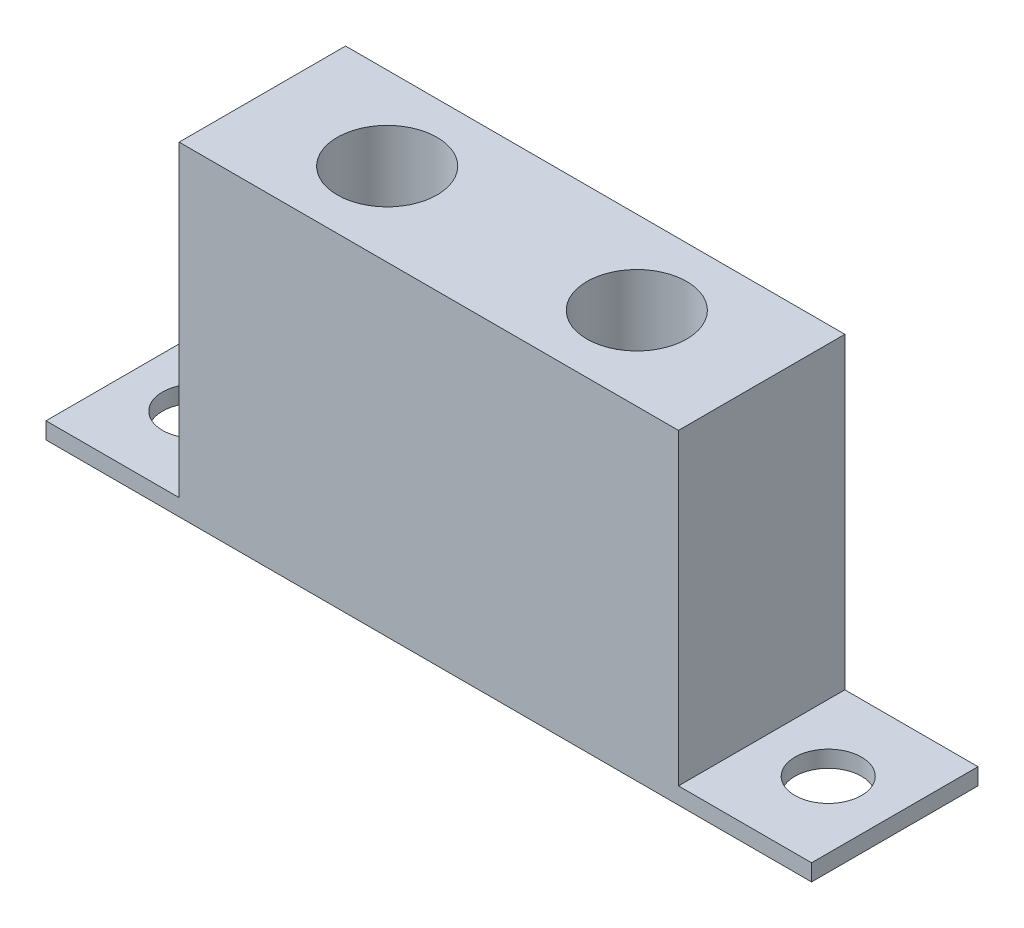
ISO-10303-21;
HEADER;
FILE_DESCRIPTION(('STEP AP214'),'2;1');
FILE_NAME('part.step','',(''),(''),'','','');
FILE_SCHEMA(('AUTOMOTIVE_DESIGN { 1 0 10303 214 1 1 1 1 }'));
ENDSEC;
DATA;
#1=APPLICATION_CONTEXT('core data for automotive mechanical design processes');
#2=APPLICATION_PROTOCOL_DEFINITION('international standard','automotive_design',2000,#1);
#3=PRODUCT_CONTEXT('',#1,'mechanical');
#4=PRODUCT('Part','Part','',(#3));
#5=PRODUCT_RELATED_PRODUCT_CATEGORY('part','',(#4));
#6=PRODUCT_DEFINITION_FORMATION('','',#4);
#7=PRODUCT_DEFINITION_CONTEXT('part definition',#1,'design');
#8=PRODUCT_DEFINITION('design','',#6,#7);
#9=PRODUCT_DEFINITION_SHAPE('','',#8);
#10=(LENGTH_UNIT() NAMED_UNIT(*) SI_UNIT(.MILLI.,.METRE.));
#11=(NAMED_UNIT(*) PLANE_ANGLE_UNIT() SI_UNIT($,.RADIAN.));
#12=(NAMED_UNIT(*) SI_UNIT($,.STERADIAN.) SOLID_ANGLE_UNIT());
#13=UNCERTAINTY_MEASURE_WITH_UNIT(LENGTH_MEASURE(1.E-05),#10,'distance_accuracy_value','');
#14=(GEOMETRIC_REPRESENTATION_CONTEXT(3) GLOBAL_UNCERTAINTY_ASSIGNED_CONTEXT((#13)) GLOBAL_UNIT_ASSIGNED_CONTEXT((#10,
#11,#12)) REPRESENTATION_CONTEXT('',''));
#15=CARTESIAN_POINT('',(0.,0.,0.));
#16=DIRECTION('',(0.,0.,1.));
#17=DIRECTION('',(1.,0.,0.));
#18=AXIS2_PLACEMENT_3D('',#15,#16,#17);
#19=CARTESIAN_POINT('',(-7.84172661870503,9.75,2.5));
#20=DIRECTION('',(1.,0.,0.));
#21=DIRECTION('',(0.,0.,-1.));
#22=AXIS2_PLACEMENT_3D('',#19,#20,#21);
#23=PLANE('',#22);
#24=DIRECTION('',(0.,0.,-1.));
#25=VECTOR('',#24,1.);
#26=CARTESIAN_POINT('',(-7.84172661870503,0.5,-2.5));
#27=LINE('',#26,#25);
#28=CARTESIAN_POINT('',(-7.84172661870503,0.5,2.5));
#29=VERTEX_POINT('',#28);
#30=CARTESIAN_POINT('',(-7.84172661870503,0.5,-2.5));
#31=VERTEX_POINT('',#30);
#32=EDGE_CURVE('E59',#29,#31,#27,.T.);
#33=ORIENTED_EDGE('',*,*,#32,.F.);
#34=DIRECTION('',(0.,-1.,0.));
#35=VECTOR('',#34,1.);
#36=CARTESIAN_POINT('',(-7.84172661870503,9.75,2.5));
#37=LINE('',#36,#35);
#38=CARTESIAN_POINT('',(-7.84172661870503,9.75,2.5));
#39=VERTEX_POINT('',#38);
#40=EDGE_CURVE('E211',#39,#29,#37,.T.);
#41=ORIENTED_EDGE('',*,*,#40,.F.);
#42=DIRECTION('',(0.,0.,1.));
#43=VECTOR('',#42,1.);
#44=CARTESIAN_POINT('',(-7.84172661870503,9.75,2.5));
#45=LINE('',#44,#43);
#46=CARTESIAN_POINT('',(-7.84172661870503,9.75,-2.5));
#47=VERTEX_POINT('',#46);
#48=EDGE_CURVE('E200',#47,#39,#45,.T.);
#49=ORIENTED_EDGE('',*,*,#48,.F.);
#50=DIRECTION('',(0.,-1.,0.));
#51=VECTOR('',#50,1.);
#52=CARTESIAN_POINT('',(-7.84172661870503,9.75,-2.5));
#53=LINE('',#52,#51);
#54=EDGE_CURVE('E52',#47,#31,#53,.T.);
#55=ORIENTED_EDGE('',*,*,#54,.T.);
#56=EDGE_LOOP('',(#33,#41,#49,#55));
#57=FACE_BOUND('',#56,.T.);
#58=ADVANCED_FACE('F43',(#57),#23,.F.);
#59=CARTESIAN_POINT('',(7.15827338129497,9.75,2.5));
#60=DIRECTION('',(-1.,0.,0.));
#61=DIRECTION('',(0.,0.,1.));
#62=AXIS2_PLACEMENT_3D('',#59,#60,#61);
#63=PLANE('',#62);
#64=DIRECTION('',(0.,0.,1.));
#65=VECTOR('',#64,1.);
#66=CARTESIAN_POINT('',(7.15827338129497,0.5,2.5));
#67=LINE('',#66,#65);
#68=CARTESIAN_POINT('',(7.15827338129497,0.5,-2.5));
#69=VERTEX_POINT('',#68);
#70=CARTESIAN_POINT('',(7.15827338129497,0.5,2.5));
#71=VERTEX_POINT('',#70);
#72=EDGE_CURVE('E67',#69,#71,#67,.T.);
#73=ORIENTED_EDGE('',*,*,#72,.F.);
#74=DIRECTION('',(0.,-1.,0.));
#75=VECTOR('',#74,1.);
#76=CARTESIAN_POINT('',(7.15827338129497,9.75,-2.5));
#77=LINE('',#76,#75);
#78=CARTESIAN_POINT('',(7.15827338129497,9.75,-2.5));
#79=VERTEX_POINT('',#78);
#80=EDGE_CURVE('E11',#79,#69,#77,.T.);
#81=ORIENTED_EDGE('',*,*,#80,.F.);
#82=DIRECTION('',(0.,0.,-1.));
#83=VECTOR('',#82,1.);
#84=CARTESIAN_POINT('',(7.15827338129497,9.75,2.5));
#85=LINE('',#84,#83);
#86=CARTESIAN_POINT('',(7.15827338129497,9.75,2.5));
#87=VERTEX_POINT('',#86);
#88=EDGE_CURVE('E193',#87,#79,#85,.T.);
#89=ORIENTED_EDGE('',*,*,#88,.F.);
#90=DIRECTION('',(0.,-1.,0.));
#91=VECTOR('',#90,1.);
#92=CARTESIAN_POINT('',(7.15827338129497,9.75,2.5));
#93=LINE('',#92,#91);
#94=EDGE_CURVE('E205',#87,#71,#93,.T.);
#95=ORIENTED_EDGE('',*,*,#94,.T.);
#96=EDGE_LOOP('',(#73,#81,#89,#95));
#97=FACE_BOUND('',#96,.T.);
#98=ADVANCED_FACE('F45',(#97),#63,.F.);
#99=CARTESIAN_POINT('',(-7.84172661870503,9.75,-2.5));
#100=DIRECTION('',(0.,0.,1.));
#101=DIRECTION('',(1.,0.,0.));
#102=AXIS2_PLACEMENT_3D('',#99,#100,#101);
#103=PLANE('',#102);
#104=DIRECTION('',(-1.,0.,0.));
#105=VECTOR('',#104,1.);
#106=CARTESIAN_POINT('',(-7.84172661870503,0.,-2.5));
#107=LINE('',#106,#105);
#108=CARTESIAN_POINT('',(11.158273381295,0.,-2.5));
#109=VERTEX_POINT('',#108);
#110=CARTESIAN_POINT('',(-11.841726618705,0.,-2.5));
#111=VERTEX_POINT('',#110);
#112=EDGE_CURVE('E110',#109,#111,#107,.T.);
#113=ORIENTED_EDGE('',*,*,#112,.T.);
#114=DIRECTION('',(0.,-1.,0.));
#115=VECTOR('',#114,1.);
#116=CARTESIAN_POINT('',(-11.841726618705,0.,-2.5));
#117=LINE('',#116,#115);
#118=CARTESIAN_POINT('',(-11.841726618705,0.5,-2.5));
#119=VERTEX_POINT('',#118);
#120=EDGE_CURVE('E115',#119,#111,#117,.T.);
#121=ORIENTED_EDGE('',*,*,#120,.F.);
#122=DIRECTION('',(1.,0.,0.));
#123=VECTOR('',#122,1.);
#124=CARTESIAN_POINT('',(-11.841726618705,0.5,-2.5));
#125=LINE('',#124,#123);
#126=EDGE_CURVE('E148',#119,#31,#125,.T.);
#127=ORIENTED_EDGE('',*,*,#126,.T.);
#128=ORIENTED_EDGE('',*,*,#54,.F.);
#129=DIRECTION('',(-1.,0.,0.));
#130=VECTOR('',#129,1.);
#131=CARTESIAN_POINT('',(-7.84172661870503,9.75,-2.5));
#132=LINE('',#131,#130);
#133=EDGE_CURVE('E197',#79,#47,#132,.T.);
#134=ORIENTED_EDGE('',*,*,#133,.F.);
#135=ORIENTED_EDGE('',*,*,#80,.T.);
#136=DIRECTION('',(-1.,0.,0.));
#137=VECTOR('',#136,1.);
#138=CARTESIAN_POINT('',(11.158273381295,0.5,-2.5));
#139=LINE('',#138,#137);
#140=CARTESIAN_POINT('',(11.158273381295,0.5,-2.5));
#141=VERTEX_POINT('',#140);
#142=EDGE_CURVE('E174',#141,#69,#139,.T.);
#143=ORIENTED_EDGE('',*,*,#142,.F.);
#144=DIRECTION('',(0.,1.,0.));
#145=VECTOR('',#144,1.);
#146=CARTESIAN_POINT('',(11.158273381295,0.,-2.5));
#147=LINE('',#146,#145);
#148=EDGE_CURVE('E117',#109,#141,#147,.T.);
#149=ORIENTED_EDGE('',*,*,#148,.F.);
#150=EDGE_LOOP('',(#113,#121,#127,#128,#134,#135,#143,#149));
#151=FACE_BOUND('',#150,.T.);
#152=ADVANCED_FACE('F112',(#151),#103,.F.);
#153=CARTESIAN_POINT('',(-7.84172661870503,9.75,2.5));
#154=DIRECTION('',(0.,0.,-1.));
#155=DIRECTION('',(-1.,0.,0.));
#156=AXIS2_PLACEMENT_3D('',#153,#154,#155);
#157=PLANE('',#156);
#158=DIRECTION('',(1.,0.,0.));
#159=VECTOR('',#158,1.);
#160=CARTESIAN_POINT('',(-7.84172661870503,0.,2.5));
#161=LINE('',#160,#159);
#162=CARTESIAN_POINT('',(-11.841726618705,0.,2.5));
#163=VERTEX_POINT('',#162);
#164=CARTESIAN_POINT('',(11.158273381295,0.,2.5));
#165=VERTEX_POINT('',#164);
#166=EDGE_CURVE('E122',#163,#165,#161,.T.);
#167=ORIENTED_EDGE('',*,*,#166,.T.);
#168=DIRECTION('',(0.,-1.,0.));
#169=VECTOR('',#168,1.);
#170=CARTESIAN_POINT('',(11.158273381295,0.,2.5));
#171=LINE('',#170,#169);
#172=CARTESIAN_POINT('',(11.158273381295,0.5,2.5));
#173=VERTEX_POINT('',#172);
#174=EDGE_CURVE('E156',#173,#165,#171,.T.);
#175=ORIENTED_EDGE('',*,*,#174,.F.);
#176=DIRECTION('',(-1.,0.,0.));
#177=VECTOR('',#176,1.);
#178=CARTESIAN_POINT('',(11.158273381295,0.5,2.5));
#179=LINE('',#178,#177);
#180=EDGE_CURVE('E168',#173,#71,#179,.T.);
#181=ORIENTED_EDGE('',*,*,#180,.T.);
#182=ORIENTED_EDGE('',*,*,#94,.F.);
#183=DIRECTION('',(1.,0.,0.));
#184=VECTOR('',#183,1.);
#185=CARTESIAN_POINT('',(-7.84172661870503,9.75,2.5));
#186=LINE('',#185,#184);
#187=EDGE_CURVE('E203',#39,#87,#186,.T.);
#188=ORIENTED_EDGE('',*,*,#187,.F.);
#189=ORIENTED_EDGE('',*,*,#40,.T.);
#190=DIRECTION('',(1.,0.,0.));
#191=VECTOR('',#190,1.);
#192=CARTESIAN_POINT('',(-11.841726618705,0.5,2.5));
#193=LINE('',#192,#191);
#194=CARTESIAN_POINT('',(-11.841726618705,0.5,2.5));
#195=VERTEX_POINT('',#194);
#196=EDGE_CURVE('E152',#195,#29,#193,.T.);
#197=ORIENTED_EDGE('',*,*,#196,.F.);
#198=DIRECTION('',(0.,1.,0.));
#199=VECTOR('',#198,1.);
#200=CARTESIAN_POINT('',(-11.841726618705,0.,2.5));
#201=LINE('',#200,#199);
#202=EDGE_CURVE('E131',#163,#195,#201,.T.);
#203=ORIENTED_EDGE('',*,*,#202,.F.);
#204=EDGE_LOOP('',(#167,#175,#181,#182,#188,#189,#197,#203));
#205=FACE_BOUND('',#204,.T.);
#206=ADVANCED_FACE('F220',(#205),#157,.F.);
#207=CARTESIAN_POINT('',(0.,9.75,0.));
#208=DIRECTION('',(0.,-1.,0.));
#209=DIRECTION('',(0.,0.,-1.));
#210=AXIS2_PLACEMENT_3D('',#207,#208,#209);
#211=PLANE('',#210);
#212=CARTESIAN_POINT('',(-4.09172661870503,9.75,0.));
#213=DIRECTION('',(0.,1.,0.));
#214=DIRECTION('',(0.,0.,1.));
#215=AXIS2_PLACEMENT_3D('',#212,#213,#214);
#216=CIRCLE('',#215,1.5);
#217=CARTESIAN_POINT('',(-4.09172661870503,9.75,1.5));
#218=VERTEX_POINT('',#217);
#219=EDGE_CURVE('E182',#218,#218,#216,.T.);
#220=ORIENTED_EDGE('',*,*,#219,.F.);
#221=EDGE_LOOP('',(#220));
#222=FACE_BOUND('',#221,.T.);
#223=CARTESIAN_POINT('',(3.40827338129497,9.75,0.));
#224=DIRECTION('',(0.,1.,0.));
#225=DIRECTION('',(0.,0.,1.));
#226=AXIS2_PLACEMENT_3D('',#223,#224,#225);
#227=CIRCLE('',#226,1.5);
#228=CARTESIAN_POINT('',(3.40827338129497,9.75,1.5));
#229=VERTEX_POINT('',#228);
#230=EDGE_CURVE('E186',#229,#229,#227,.T.);
#231=ORIENTED_EDGE('',*,*,#230,.F.);
#232=EDGE_LOOP('',(#231));
#233=FACE_BOUND('',#232,.T.);
#234=ORIENTED_EDGE('',*,*,#88,.T.);
#235=ORIENTED_EDGE('',*,*,#133,.T.);
#236=ORIENTED_EDGE('',*,*,#48,.T.);
#237=ORIENTED_EDGE('',*,*,#187,.T.);
#238=EDGE_LOOP('',(#234,#235,#236,#237));
#239=FACE_BOUND('',#238,.T.);
#240=ADVANCED_FACE('F225',(#222,#233,#239),#211,.F.);
#241=CARTESIAN_POINT('',(0.,0.,0.));
#242=DIRECTION('',(0.,-1.,0.));
#243=DIRECTION('',(0.,0.,-1.));
#244=AXIS2_PLACEMENT_3D('',#241,#242,#243);
#245=PLANE('',#244);
#246=CARTESIAN_POINT('',(-9.84172661870503,0.,0.));
#247=DIRECTION('',(0.,-1.,0.));
#248=DIRECTION('',(0.,0.,-1.));
#249=AXIS2_PLACEMENT_3D('',#246,#247,#248);
#250=CIRCLE('',#249,1.);
#251=CARTESIAN_POINT('',(-9.84172661870503,0.,-1.));
#252=VERTEX_POINT('',#251);
#253=EDGE_CURVE('E440',#252,#252,#250,.T.);
#254=ORIENTED_EDGE('',*,*,#253,.F.);
#255=EDGE_LOOP('',(#254));
#256=FACE_BOUND('',#255,.T.);
#257=CARTESIAN_POINT('',(9.15827338129497,0.,0.));
#258=DIRECTION('',(0.,-1.,0.));
#259=DIRECTION('',(0.,0.,-1.));
#260=AXIS2_PLACEMENT_3D('',#257,#258,#259);
#261=CIRCLE('',#260,1.);
#262=CARTESIAN_POINT('',(9.15827338129497,0.,-1.));
#263=VERTEX_POINT('',#262);
#264=EDGE_CURVE('E140',#263,#263,#261,.T.);
#265=ORIENTED_EDGE('',*,*,#264,.F.);
#266=EDGE_LOOP('',(#265));
#267=FACE_BOUND('',#266,.T.);
#268=ORIENTED_EDGE('',*,*,#112,.F.);
#269=DIRECTION('',(0.,0.,-1.));
#270=VECTOR('',#269,1.);
#271=CARTESIAN_POINT('',(11.158273381295,0.,2.5));
#272=LINE('',#271,#270);
#273=EDGE_CURVE('E160',#165,#109,#272,.T.);
#274=ORIENTED_EDGE('',*,*,#273,.F.);
#275=ORIENTED_EDGE('',*,*,#166,.F.);
#276=DIRECTION('',(0.,0.,1.));
#277=VECTOR('',#276,1.);
#278=CARTESIAN_POINT('',(-11.841726618705,0.,-2.5));
#279=LINE('',#278,#277);
#280=EDGE_CURVE('E126',#111,#163,#279,.T.);
#281=ORIENTED_EDGE('',*,*,#280,.F.);
#282=EDGE_LOOP('',(#268,#274,#275,#281));
#283=FACE_BOUND('',#282,.T.);
#284=ADVANCED_FACE('F127',(#256,#267,#283),#245,.T.);
#285=CARTESIAN_POINT('',(3.40827338129497,5.75,0.));
#286=DIRECTION('',(0.,1.,0.));
#287=DIRECTION('',(0.,0.,1.));
#288=AXIS2_PLACEMENT_3D('',#285,#286,#287);
#289=CYLINDRICAL_SURFACE('',#288,1.5);
#290=CARTESIAN_POINT('',(3.40827338129497,5.75,0.));
#291=DIRECTION('',(0.,1.,0.));
#292=DIRECTION('',(0.,0.,1.));
#293=AXIS2_PLACEMENT_3D('',#290,#291,#292);
#294=CIRCLE('',#293,1.5);
#295=CARTESIAN_POINT('',(3.40827338129497,5.75,1.5));
#296=VERTEX_POINT('',#295);
#297=EDGE_CURVE('E178',#296,#296,#294,.T.);
#298=ORIENTED_EDGE('',*,*,#297,.F.);
#299=EDGE_LOOP('',(#298));
#300=FACE_BOUND('',#299,.T.);
#301=ORIENTED_EDGE('',*,*,#230,.T.);
#302=EDGE_LOOP('',(#301));
#303=FACE_BOUND('',#302,.T.);
#304=ADVANCED_FACE('F263',(#300,#303),#289,.F.);
#305=CARTESIAN_POINT('',(3.40827338129497,5.75,0.));
#306=DIRECTION('',(0.,1.,0.));
#307=DIRECTION('',(0.,0.,1.));
#308=AXIS2_PLACEMENT_3D('',#305,#306,#307);
#309=PLANE('',#308);
#310=ORIENTED_EDGE('',*,*,#297,.T.);
#311=EDGE_LOOP('',(#310));
#312=FACE_BOUND('',#311,.T.);
#313=ADVANCED_FACE('F268',(#312),#309,.T.);
#314=CARTESIAN_POINT('',(-4.09172661870503,5.75,0.));
#315=DIRECTION('',(0.,1.,0.));
#316=DIRECTION('',(0.,0.,1.));
#317=AXIS2_PLACEMENT_3D('',#314,#315,#316);
#318=CYLINDRICAL_SURFACE('',#317,1.5);
#319=CARTESIAN_POINT('',(-4.09172661870503,5.75,0.));
#320=DIRECTION('',(0.,1.,0.));
#321=DIRECTION('',(0.,0.,1.));
#322=AXIS2_PLACEMENT_3D('',#319,#320,#321);
#323=CIRCLE('',#322,1.5);
#324=CARTESIAN_POINT('',(-4.09172661870503,5.75,1.5));
#325=VERTEX_POINT('',#324);
#326=EDGE_CURVE('E123',#325,#325,#323,.T.);
#327=ORIENTED_EDGE('',*,*,#326,.F.);
#328=EDGE_LOOP('',(#327));
#329=FACE_BOUND('',#328,.T.);
#330=ORIENTED_EDGE('',*,*,#219,.T.);
#331=EDGE_LOOP('',(#330));
#332=FACE_BOUND('',#331,.T.);
#333=ADVANCED_FACE('F271',(#329,#332),#318,.F.);
#334=CARTESIAN_POINT('',(-4.09172661870503,5.75,0.));
#335=DIRECTION('',(0.,1.,0.));
#336=DIRECTION('',(0.,0.,1.));
#337=AXIS2_PLACEMENT_3D('',#334,#335,#336);
#338=PLANE('',#337);
#339=ORIENTED_EDGE('',*,*,#326,.T.);
#340=EDGE_LOOP('',(#339));
#341=FACE_BOUND('',#340,.T.);
#342=ADVANCED_FACE('F241',(#341),#338,.T.);
#343=CARTESIAN_POINT('',(11.158273381295,0.5,2.5));
#344=DIRECTION('',(0.,-1.,0.));
#345=DIRECTION('',(0.,0.,-1.));
#346=AXIS2_PLACEMENT_3D('',#343,#344,#345);
#347=PLANE('',#346);
#348=CARTESIAN_POINT('',(9.15827338129497,0.5,0.));
#349=DIRECTION('',(0.,1.,0.));
#350=DIRECTION('',(0.,0.,1.));
#351=AXIS2_PLACEMENT_3D('',#348,#349,#350);
#352=CIRCLE('',#351,1.);
#353=CARTESIAN_POINT('',(9.15827338129497,0.5,1.));
#354=VERTEX_POINT('',#353);
#355=EDGE_CURVE('E434',#354,#354,#352,.T.);
#356=ORIENTED_EDGE('',*,*,#355,.F.);
#357=EDGE_LOOP('',(#356));
#358=FACE_BOUND('',#357,.T.);
#359=ORIENTED_EDGE('',*,*,#72,.T.);
#360=ORIENTED_EDGE('',*,*,#180,.F.);
#361=DIRECTION('',(0.,0.,1.));
#362=VECTOR('',#361,1.);
#363=CARTESIAN_POINT('',(11.158273381295,0.5,2.5));
#364=LINE('',#363,#362);
#365=EDGE_CURVE('E165',#141,#173,#364,.T.);
#366=ORIENTED_EDGE('',*,*,#365,.F.);
#367=ORIENTED_EDGE('',*,*,#142,.T.);
#368=EDGE_LOOP('',(#359,#360,#366,#367));
#369=FACE_BOUND('',#368,.T.);
#370=ADVANCED_FACE('F228',(#358,#369),#347,.F.);
#371=CARTESIAN_POINT('',(11.158273381295,0.,0.));
#372=DIRECTION('',(-1.,0.,0.));
#373=DIRECTION('',(0.,0.,1.));
#374=AXIS2_PLACEMENT_3D('',#371,#372,#373);
#375=PLANE('',#374);
#376=ORIENTED_EDGE('',*,*,#174,.T.);
#377=ORIENTED_EDGE('',*,*,#273,.T.);
#378=ORIENTED_EDGE('',*,*,#148,.T.);
#379=ORIENTED_EDGE('',*,*,#365,.T.);
#380=EDGE_LOOP('',(#376,#377,#378,#379));
#381=FACE_BOUND('',#380,.T.);
#382=ADVANCED_FACE('F232',(#381),#375,.F.);
#383=CARTESIAN_POINT('',(-11.841726618705,0.5,-2.5));
#384=DIRECTION('',(0.,-1.,0.));
#385=DIRECTION('',(0.,0.,-1.));
#386=AXIS2_PLACEMENT_3D('',#383,#384,#385);
#387=PLANE('',#386);
#388=CARTESIAN_POINT('',(-9.84172661870503,0.5,0.));
#389=DIRECTION('',(0.,1.,0.));
#390=DIRECTION('',(0.,0.,1.));
#391=AXIS2_PLACEMENT_3D('',#388,#389,#390);
#392=CIRCLE('',#391,1.);
#393=CARTESIAN_POINT('',(-9.84172661870503,0.5,1.));
#394=VERTEX_POINT('',#393);
#395=EDGE_CURVE('E436',#394,#394,#392,.T.);
#396=ORIENTED_EDGE('',*,*,#395,.F.);
#397=EDGE_LOOP('',(#396));
#398=FACE_BOUND('',#397,.T.);
#399=ORIENTED_EDGE('',*,*,#32,.T.);
#400=ORIENTED_EDGE('',*,*,#126,.F.);
#401=DIRECTION('',(0.,0.,-1.));
#402=VECTOR('',#401,1.);
#403=CARTESIAN_POINT('',(-11.841726618705,0.5,-2.5));
#404=LINE('',#403,#402);
#405=EDGE_CURVE('E135',#195,#119,#404,.T.);
#406=ORIENTED_EDGE('',*,*,#405,.F.);
#407=ORIENTED_EDGE('',*,*,#196,.T.);
#408=EDGE_LOOP('',(#399,#400,#406,#407));
#409=FACE_BOUND('',#408,.T.);
#410=ADVANCED_FACE('F217',(#398,#409),#387,.F.);
#411=CARTESIAN_POINT('',(-11.841726618705,0.,0.));
#412=DIRECTION('',(1.,0.,0.));
#413=DIRECTION('',(0.,0.,-1.));
#414=AXIS2_PLACEMENT_3D('',#411,#412,#413);
#415=PLANE('',#414);
#416=ORIENTED_EDGE('',*,*,#120,.T.);
#417=ORIENTED_EDGE('',*,*,#280,.T.);
#418=ORIENTED_EDGE('',*,*,#202,.T.);
#419=ORIENTED_EDGE('',*,*,#405,.T.);
#420=EDGE_LOOP('',(#416,#417,#418,#419));
#421=FACE_BOUND('',#420,.T.);
#422=ADVANCED_FACE('F133',(#421),#415,.F.);
#423=CARTESIAN_POINT('',(-9.84172661870503,-3.5,0.));
#424=DIRECTION('',(0.,1.,0.));
#425=DIRECTION('',(0.,0.,1.));
#426=AXIS2_PLACEMENT_3D('',#423,#424,#425);
#427=CYLINDRICAL_SURFACE('',#426,1.);
#428=ORIENTED_EDGE('',*,*,#253,.T.);
#429=EDGE_LOOP('',(#428));
#430=FACE_BOUND('',#429,.T.);
#431=ORIENTED_EDGE('',*,*,#395,.T.);
#432=EDGE_LOOP('',(#431));
#433=FACE_BOUND('',#432,.T.);
#434=ADVANCED_FACE('F313',(#430,#433),#427,.F.);
#435=CARTESIAN_POINT('',(9.15827338129497,-3.5,0.));
#436=DIRECTION('',(0.,1.,0.));
#437=DIRECTION('',(0.,0.,1.));
#438=AXIS2_PLACEMENT_3D('',#435,#436,#437);
#439=CYLINDRICAL_SURFACE('',#438,1.);
#440=ORIENTED_EDGE('',*,*,#264,.T.);
#441=EDGE_LOOP('',(#440));
#442=FACE_BOUND('',#441,.T.);
#443=ORIENTED_EDGE('',*,*,#355,.T.);
#444=EDGE_LOOP('',(#443));
#445=FACE_BOUND('',#444,.T.);
#446=ADVANCED_FACE('F318',(#442,#445),#439,.F.);
#447=CLOSED_SHELL('',(#58,#98,#152,#206,#240,#284,#304,#313,#333,#342,#370,#382,#410,#422,#434,#446));
#448=MANIFOLD_SOLID_BREP('B2',#447);
#449=ADVANCED_BREP_SHAPE_REPRESENTATION('',(#18,#448),#14);
#450=SHAPE_DEFINITION_REPRESENTATION(#9,#449);
ENDSEC;
END-ISO-10303-21;
